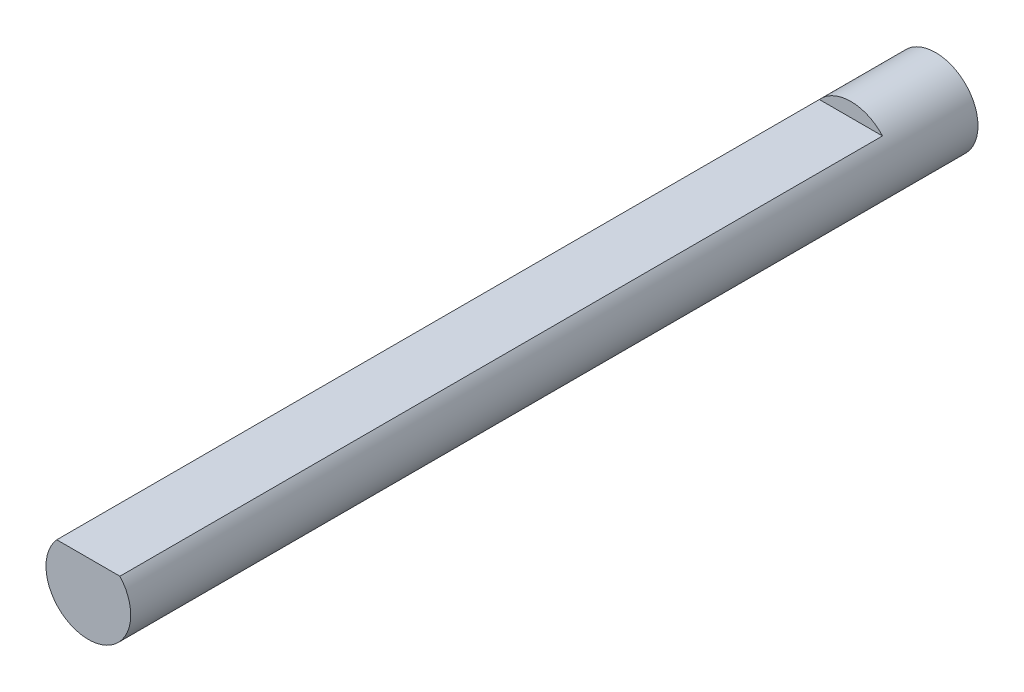
ISO-10303-21;
HEADER;
FILE_DESCRIPTION(('STEP AP214'),'2;1');
FILE_NAME('part.step','',(''),(''),'','','');
FILE_SCHEMA(('AUTOMOTIVE_DESIGN { 1 0 10303 214 1 1 1 1 }'));
ENDSEC;
DATA;
#1=APPLICATION_CONTEXT('core data for automotive mechanical design processes');
#2=APPLICATION_PROTOCOL_DEFINITION('international standard','automotive_design',2000,#1);
#3=PRODUCT_CONTEXT('',#1,'mechanical');
#4=PRODUCT('Part','Part','',(#3));
#5=PRODUCT_RELATED_PRODUCT_CATEGORY('part','',(#4));
#6=PRODUCT_DEFINITION_FORMATION('','',#4);
#7=PRODUCT_DEFINITION_CONTEXT('part definition',#1,'design');
#8=PRODUCT_DEFINITION('design','',#6,#7);
#9=PRODUCT_DEFINITION_SHAPE('','',#8);
#10=(LENGTH_UNIT() NAMED_UNIT(*) SI_UNIT(.MILLI.,.METRE.));
#11=(NAMED_UNIT(*) PLANE_ANGLE_UNIT() SI_UNIT($,.RADIAN.));
#12=(NAMED_UNIT(*) SI_UNIT($,.STERADIAN.) SOLID_ANGLE_UNIT());
#13=UNCERTAINTY_MEASURE_WITH_UNIT(LENGTH_MEASURE(1.E-05),#10,'distance_accuracy_value','');
#14=(GEOMETRIC_REPRESENTATION_CONTEXT(3) GLOBAL_UNCERTAINTY_ASSIGNED_CONTEXT((#13)) GLOBAL_UNIT_ASSIGNED_CONTEXT((#10,
#11,#12)) REPRESENTATION_CONTEXT('',''));
#15=CARTESIAN_POINT('',(0.,0.,0.));
#16=DIRECTION('',(0.,0.,1.));
#17=DIRECTION('',(1.,0.,0.));
#18=AXIS2_PLACEMENT_3D('',#15,#16,#17);
#19=CARTESIAN_POINT('',(0.,0.,15.));
#20=DIRECTION('',(0.,0.,-1.));
#21=DIRECTION('',(-1.,0.,0.));
#22=AXIS2_PLACEMENT_3D('',#19,#20,#21);
#23=CYLINDRICAL_SURFACE('',#22,1.5);
#24=CARTESIAN_POINT('',(0.,0.,15.));
#25=DIRECTION('',(0.,0.,1.));
#26=DIRECTION('',(1.,0.,0.));
#27=AXIS2_PLACEMENT_3D('',#24,#25,#26);
#28=CIRCLE('',#27,1.5);
#29=CARTESIAN_POINT('',(-1.1180339887499,1.,15.));
#30=VERTEX_POINT('',#29);
#31=CARTESIAN_POINT('',(1.1180339887499,1.,15.));
#32=VERTEX_POINT('',#31);
#33=EDGE_CURVE('E11',#30,#32,#28,.T.);
#34=ORIENTED_EDGE('',*,*,#33,.F.);
#35=DIRECTION('',(0.,0.,1.));
#36=VECTOR('',#35,1.);
#37=CARTESIAN_POINT('',(-1.1180339887499,1.,-12.));
#38=LINE('',#37,#36);
#39=CARTESIAN_POINT('',(-1.1180339887499,1.,-12.));
#40=VERTEX_POINT('',#39);
#41=EDGE_CURVE('E51',#40,#30,#38,.T.);
#42=ORIENTED_EDGE('',*,*,#41,.F.);
#43=CARTESIAN_POINT('',(0.,0.,-12.));
#44=DIRECTION('',(0.,0.,1.));
#45=DIRECTION('',(1.,0.,0.));
#46=AXIS2_PLACEMENT_3D('',#43,#44,#45);
#47=CIRCLE('',#46,1.5);
#48=CARTESIAN_POINT('',(1.1180339887499,1.,-12.));
#49=VERTEX_POINT('',#48);
#50=EDGE_CURVE('E66',#49,#40,#47,.T.);
#51=ORIENTED_EDGE('',*,*,#50,.F.);
#52=DIRECTION('',(0.,0.,1.));
#53=VECTOR('',#52,1.);
#54=CARTESIAN_POINT('',(1.1180339887499,1.,-12.));
#55=LINE('',#54,#53);
#56=EDGE_CURVE('E57',#49,#32,#55,.T.);
#57=ORIENTED_EDGE('',*,*,#56,.T.);
#58=EDGE_LOOP('',(#34,#42,#51,#57));
#59=FACE_BOUND('',#58,.T.);
#60=CARTESIAN_POINT('',(0.,0.,-15.));
#61=DIRECTION('',(0.,0.,1.));
#62=DIRECTION('',(1.,0.,0.));
#63=AXIS2_PLACEMENT_3D('',#60,#61,#62);
#64=CIRCLE('',#63,1.5);
#65=CARTESIAN_POINT('',(1.5,0.,-15.));
#66=VERTEX_POINT('',#65);
#67=EDGE_CURVE('E40',#66,#66,#64,.T.);
#68=ORIENTED_EDGE('',*,*,#67,.T.);
#69=EDGE_LOOP('',(#68));
#70=FACE_BOUND('',#69,.T.);
#71=ADVANCED_FACE('F37',(#59,#70),#23,.T.);
#72=CARTESIAN_POINT('',(0.,0.,15.));
#73=DIRECTION('',(0.,0.,1.));
#74=DIRECTION('',(1.,0.,0.));
#75=AXIS2_PLACEMENT_3D('',#72,#73,#74);
#76=PLANE('',#75);
#77=DIRECTION('',(1.,0.,0.));
#78=VECTOR('',#77,1.);
#79=CARTESIAN_POINT('',(1.1180339887499,1.,15.));
#80=LINE('',#79,#78);
#81=EDGE_CURVE('E62',#30,#32,#80,.T.);
#82=ORIENTED_EDGE('',*,*,#81,.F.);
#83=ORIENTED_EDGE('',*,*,#33,.T.);
#84=EDGE_LOOP('',(#82,#83));
#85=FACE_BOUND('',#84,.T.);
#86=ADVANCED_FACE('F72',(#85),#76,.T.);
#87=CARTESIAN_POINT('',(0.,0.,-15.));
#88=DIRECTION('',(0.,0.,1.));
#89=DIRECTION('',(1.,0.,0.));
#90=AXIS2_PLACEMENT_3D('',#87,#88,#89);
#91=PLANE('',#90);
#92=ORIENTED_EDGE('',*,*,#67,.F.);
#93=EDGE_LOOP('',(#92));
#94=FACE_BOUND('',#93,.T.);
#95=ADVANCED_FACE('F74',(#94),#91,.F.);
#96=CARTESIAN_POINT('',(1.1180339887499,1.,-12.));
#97=DIRECTION('',(0.,-1.,0.));
#98=DIRECTION('',(0.,0.,-1.));
#99=AXIS2_PLACEMENT_3D('',#96,#97,#98);
#100=PLANE('',#99);
#101=ORIENTED_EDGE('',*,*,#81,.T.);
#102=ORIENTED_EDGE('',*,*,#56,.F.);
#103=DIRECTION('',(1.,0.,0.));
#104=VECTOR('',#103,1.);
#105=CARTESIAN_POINT('',(1.1180339887499,1.,-12.));
#106=LINE('',#105,#104);
#107=EDGE_CURVE('E89',#40,#49,#106,.T.);
#108=ORIENTED_EDGE('',*,*,#107,.F.);
#109=ORIENTED_EDGE('',*,*,#41,.T.);
#110=EDGE_LOOP('',(#101,#102,#108,#109));
#111=FACE_BOUND('',#110,.T.);
#112=ADVANCED_FACE('F63',(#111),#100,.F.);
#113=CARTESIAN_POINT('',(0.,0.,-12.));
#114=DIRECTION('',(0.,0.,1.));
#115=DIRECTION('',(1.,0.,0.));
#116=AXIS2_PLACEMENT_3D('',#113,#114,#115);
#117=PLANE('',#116);
#118=ORIENTED_EDGE('',*,*,#50,.T.);
#119=ORIENTED_EDGE('',*,*,#107,.T.);
#120=EDGE_LOOP('',(#118,#119));
#121=FACE_BOUND('',#120,.T.);
#122=ADVANCED_FACE('F84',(#121),#117,.T.);
#123=CLOSED_SHELL('',(#71,#86,#95,#112,#122));
#124=MANIFOLD_SOLID_BREP('B2',#123);
#125=ADVANCED_BREP_SHAPE_REPRESENTATION('',(#18,#124),#14);
#126=SHAPE_DEFINITION_REPRESENTATION(#9,#125);
ENDSEC;
END-ISO-10303-21;
